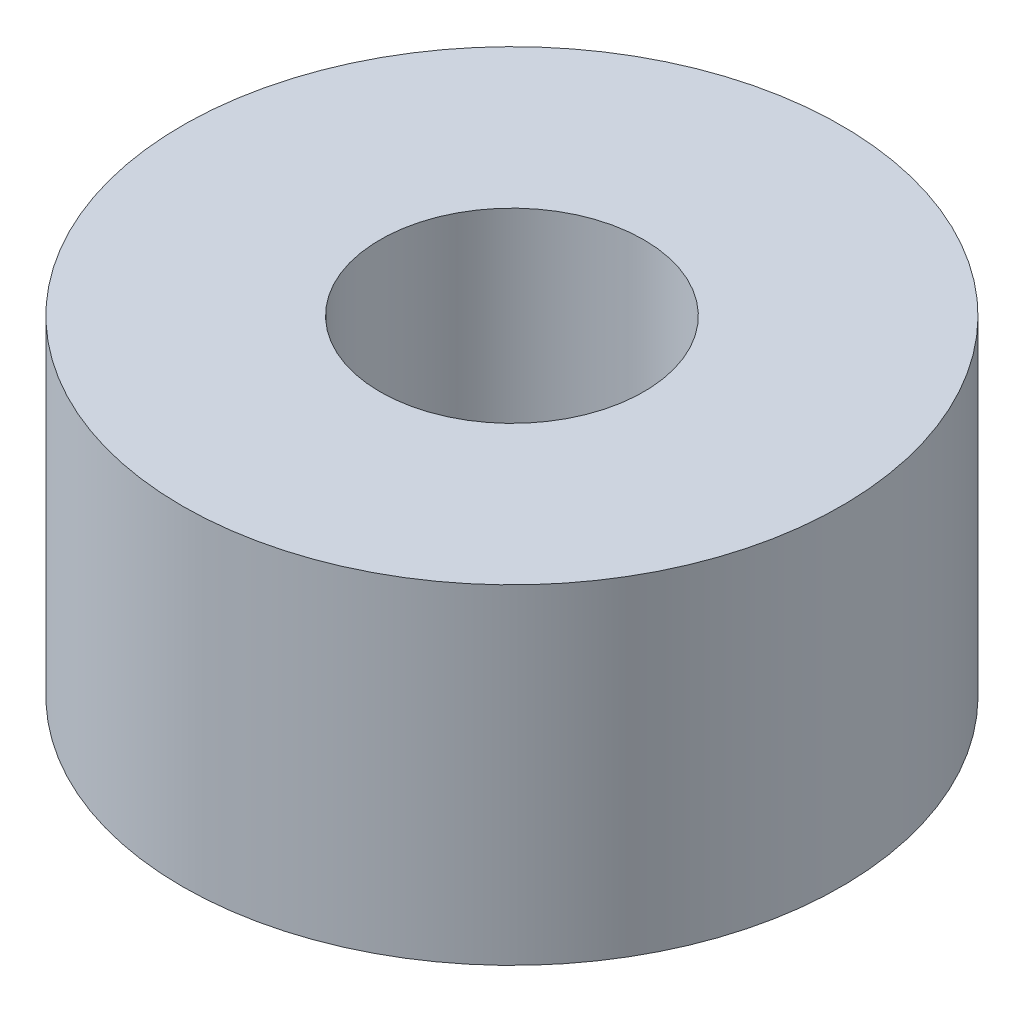
ISO-10303-21;
HEADER;
FILE_DESCRIPTION(('STEP AP214'),'2;1');
FILE_NAME('part.step','',(''),(''),'','','');
FILE_SCHEMA(('AUTOMOTIVE_DESIGN { 1 0 10303 214 1 1 1 1 }'));
ENDSEC;
DATA;
#1=APPLICATION_CONTEXT('core data for automotive mechanical design processes');
#2=APPLICATION_PROTOCOL_DEFINITION('international standard','automotive_design',2000,#1);
#3=PRODUCT_CONTEXT('',#1,'mechanical');
#4=PRODUCT('Part','Part','',(#3));
#5=PRODUCT_RELATED_PRODUCT_CATEGORY('part','',(#4));
#6=PRODUCT_DEFINITION_FORMATION('','',#4);
#7=PRODUCT_DEFINITION_CONTEXT('part definition',#1,'design');
#8=PRODUCT_DEFINITION('design','',#6,#7);
#9=PRODUCT_DEFINITION_SHAPE('','',#8);
#10=(LENGTH_UNIT() NAMED_UNIT(*) SI_UNIT(.MILLI.,.METRE.));
#11=(NAMED_UNIT(*) PLANE_ANGLE_UNIT() SI_UNIT($,.RADIAN.));
#12=(NAMED_UNIT(*) SI_UNIT($,.STERADIAN.) SOLID_ANGLE_UNIT());
#13=UNCERTAINTY_MEASURE_WITH_UNIT(LENGTH_MEASURE(1.E-05),#10,'distance_accuracy_value','');
#14=(GEOMETRIC_REPRESENTATION_CONTEXT(3) GLOBAL_UNCERTAINTY_ASSIGNED_CONTEXT((#13)) GLOBAL_UNIT_ASSIGNED_CONTEXT((#10,
#11,#12)) REPRESENTATION_CONTEXT('',''));
#15=CARTESIAN_POINT('',(0.,0.,0.));
#16=DIRECTION('',(0.,0.,1.));
#17=DIRECTION('',(1.,0.,0.));
#18=AXIS2_PLACEMENT_3D('',#15,#16,#17);
#19=CARTESIAN_POINT('',(0.,2.5,0.));
#20=DIRECTION('',(0.,1.,0.));
#21=DIRECTION('',(0.,0.,1.));
#22=AXIS2_PLACEMENT_3D('',#19,#20,#21);
#23=PLANE('',#22);
#24=CARTESIAN_POINT('',(0.,2.5,0.));
#25=DIRECTION('',(0.,1.,0.));
#26=DIRECTION('',(0.,0.,1.));
#27=AXIS2_PLACEMENT_3D('',#24,#25,#26);
#28=CIRCLE('',#27,2.5);
#29=CARTESIAN_POINT('',(0.,2.5,2.5));
#30=VERTEX_POINT('',#29);
#31=EDGE_CURVE('E10',#30,#30,#28,.T.);
#32=ORIENTED_EDGE('',*,*,#31,.T.);
#33=EDGE_LOOP('',(#32));
#34=FACE_BOUND('',#33,.T.);
#35=CARTESIAN_POINT('',(0.,2.5,0.));
#36=DIRECTION('',(0.,1.,0.));
#37=DIRECTION('',(0.,0.,1.));
#38=AXIS2_PLACEMENT_3D('',#35,#36,#37);
#39=CIRCLE('',#38,1.);
#40=CARTESIAN_POINT('',(0.,2.5,1.));
#41=VERTEX_POINT('',#40);
#42=EDGE_CURVE('E44',#41,#41,#39,.T.);
#43=ORIENTED_EDGE('',*,*,#42,.F.);
#44=EDGE_LOOP('',(#43));
#45=FACE_BOUND('',#44,.T.);
#46=ADVANCED_FACE('F33',(#34,#45),#23,.T.);
#47=CARTESIAN_POINT('',(0.,0.,0.));
#48=DIRECTION('',(0.,1.,0.));
#49=DIRECTION('',(0.,0.,1.));
#50=AXIS2_PLACEMENT_3D('',#47,#48,#49);
#51=PLANE('',#50);
#52=CARTESIAN_POINT('',(0.,0.,0.));
#53=DIRECTION('',(0.,1.,0.));
#54=DIRECTION('',(0.,0.,1.));
#55=AXIS2_PLACEMENT_3D('',#52,#53,#54);
#56=CIRCLE('',#55,2.5);
#57=CARTESIAN_POINT('',(0.,0.,2.5));
#58=VERTEX_POINT('',#57);
#59=EDGE_CURVE('E37',#58,#58,#56,.T.);
#60=ORIENTED_EDGE('',*,*,#59,.F.);
#61=EDGE_LOOP('',(#60));
#62=FACE_BOUND('',#61,.T.);
#63=CARTESIAN_POINT('',(0.,0.,0.));
#64=DIRECTION('',(0.,1.,0.));
#65=DIRECTION('',(0.,0.,1.));
#66=AXIS2_PLACEMENT_3D('',#63,#64,#65);
#67=CIRCLE('',#66,1.);
#68=CARTESIAN_POINT('',(0.,0.,1.));
#69=VERTEX_POINT('',#68);
#70=EDGE_CURVE('E46',#69,#69,#67,.T.);
#71=ORIENTED_EDGE('',*,*,#70,.T.);
#72=EDGE_LOOP('',(#71));
#73=FACE_BOUND('',#72,.T.);
#74=ADVANCED_FACE('F56',(#62,#73),#51,.F.);
#75=CARTESIAN_POINT('',(0.,2.5,0.));
#76=DIRECTION('',(0.,-1.,0.));
#77=DIRECTION('',(0.,0.,-1.));
#78=AXIS2_PLACEMENT_3D('',#75,#76,#77);
#79=CYLINDRICAL_SURFACE('',#78,2.5);
#80=ORIENTED_EDGE('',*,*,#31,.F.);
#81=EDGE_LOOP('',(#80));
#82=FACE_BOUND('',#81,.T.);
#83=ORIENTED_EDGE('',*,*,#59,.T.);
#84=EDGE_LOOP('',(#83));
#85=FACE_BOUND('',#84,.T.);
#86=ADVANCED_FACE('F35',(#82,#85),#79,.T.);
#87=CARTESIAN_POINT('',(0.,2.5,0.));
#88=DIRECTION('',(0.,-1.,0.));
#89=DIRECTION('',(0.,0.,-1.));
#90=AXIS2_PLACEMENT_3D('',#87,#88,#89);
#91=CYLINDRICAL_SURFACE('',#90,1.);
#92=ORIENTED_EDGE('',*,*,#42,.T.);
#93=EDGE_LOOP('',(#92));
#94=FACE_BOUND('',#93,.T.);
#95=ORIENTED_EDGE('',*,*,#70,.F.);
#96=EDGE_LOOP('',(#95));
#97=FACE_BOUND('',#96,.T.);
#98=ADVANCED_FACE('F52',(#94,#97),#91,.F.);
#99=CLOSED_SHELL('',(#46,#74,#86,#98));
#100=MANIFOLD_SOLID_BREP('B2',#99);
#101=ADVANCED_BREP_SHAPE_REPRESENTATION('',(#18,#100),#14);
#102=SHAPE_DEFINITION_REPRESENTATION(#9,#101);
ENDSEC;
END-ISO-10303-21;
